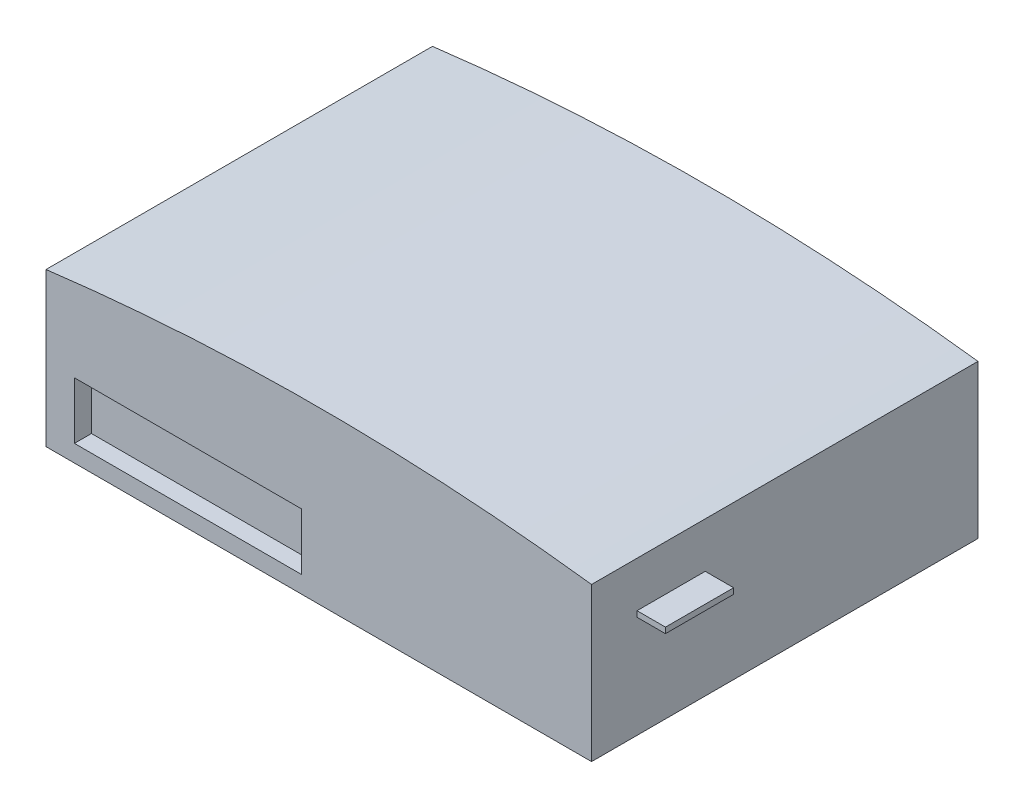
ISO-10303-21;
HEADER;
FILE_DESCRIPTION(('STEP AP214'),'2;1');
FILE_NAME('part.step','',(''),(''),'','','');
FILE_SCHEMA(('AUTOMOTIVE_DESIGN { 1 0 10303 214 1 1 1 1 }'));
ENDSEC;
DATA;
#1=APPLICATION_CONTEXT('core data for automotive mechanical design processes');
#2=APPLICATION_PROTOCOL_DEFINITION('international standard','automotive_design',2000,#1);
#3=PRODUCT_CONTEXT('',#1,'mechanical');
#4=PRODUCT('Part','Part','',(#3));
#5=PRODUCT_RELATED_PRODUCT_CATEGORY('part','',(#4));
#6=PRODUCT_DEFINITION_FORMATION('','',#4);
#7=PRODUCT_DEFINITION_CONTEXT('part definition',#1,'design');
#8=PRODUCT_DEFINITION('design','',#6,#7);
#9=PRODUCT_DEFINITION_SHAPE('','',#8);
#10=(LENGTH_UNIT() NAMED_UNIT(*) SI_UNIT(.MILLI.,.METRE.));
#11=(NAMED_UNIT(*) PLANE_ANGLE_UNIT() SI_UNIT($,.RADIAN.));
#12=(NAMED_UNIT(*) SI_UNIT($,.STERADIAN.) SOLID_ANGLE_UNIT());
#13=UNCERTAINTY_MEASURE_WITH_UNIT(LENGTH_MEASURE(1.E-05),#10,'distance_accuracy_value','');
#14=(GEOMETRIC_REPRESENTATION_CONTEXT(3) GLOBAL_UNCERTAINTY_ASSIGNED_CONTEXT((#13)) GLOBAL_UNIT_ASSIGNED_CONTEXT((#10,
#11,#12)) REPRESENTATION_CONTEXT('',''));
#15=CARTESIAN_POINT('',(0.,0.,0.));
#16=DIRECTION('',(0.,0.,1.));
#17=DIRECTION('',(1.,0.,0.));
#18=AXIS2_PLACEMENT_3D('',#15,#16,#17);
#19=CARTESIAN_POINT('',(48.,30.,34.));
#20=DIRECTION('',(-1.,0.,0.));
#21=DIRECTION('',(0.,0.,1.));
#22=AXIS2_PLACEMENT_3D('',#19,#20,#21);
#23=PLANE('',#22);
#24=DIRECTION('',(0.,-1.,0.));
#25=VECTOR('',#24,1.);
#26=CARTESIAN_POINT('',(48.,30.,-34.));
#27=LINE('',#26,#25);
#28=CARTESIAN_POINT('',(48.,27.,-34.));
#29=VERTEX_POINT('',#28);
#30=CARTESIAN_POINT('',(48.,0.,-34.));
#31=VERTEX_POINT('',#30);
#32=EDGE_CURVE('E11',#29,#31,#27,.T.);
#33=ORIENTED_EDGE('',*,*,#32,.F.);
#34=DIRECTION('',(0.,0.,1.));
#35=VECTOR('',#34,1.);
#36=CARTESIAN_POINT('',(48.,27.,-34.));
#37=LINE('',#36,#35);
#38=CARTESIAN_POINT('',(48.,27.,34.));
#39=VERTEX_POINT('',#38);
#40=EDGE_CURVE('E182',#29,#39,#37,.T.);
#41=ORIENTED_EDGE('',*,*,#40,.T.);
#42=DIRECTION('',(0.,-1.,0.));
#43=VECTOR('',#42,1.);
#44=CARTESIAN_POINT('',(48.,30.,34.));
#45=LINE('',#44,#43);
#46=CARTESIAN_POINT('',(48.,0.,34.));
#47=VERTEX_POINT('',#46);
#48=EDGE_CURVE('E200',#39,#47,#45,.T.);
#49=ORIENTED_EDGE('',*,*,#48,.T.);
#50=DIRECTION('',(0.,0.,-1.));
#51=VECTOR('',#50,1.);
#52=CARTESIAN_POINT('',(48.,0.,34.));
#53=LINE('',#52,#51);
#54=EDGE_CURVE('E186',#47,#31,#53,.T.);
#55=ORIENTED_EDGE('',*,*,#54,.T.);
#56=EDGE_LOOP('',(#33,#41,#49,#55));
#57=FACE_BOUND('',#56,.T.);
#58=DIRECTION('',(0.,-1.,0.));
#59=VECTOR('',#58,1.);
#60=CARTESIAN_POINT('',(48.,19.,26.));
#61=LINE('',#60,#59);
#62=CARTESIAN_POINT('',(48.,19.,26.));
#63=VERTEX_POINT('',#62);
#64=CARTESIAN_POINT('',(48.,18.,26.));
#65=VERTEX_POINT('',#64);
#66=EDGE_CURVE('E140',#63,#65,#61,.T.);
#67=ORIENTED_EDGE('',*,*,#66,.F.);
#68=DIRECTION('',(0.,0.,1.));
#69=VECTOR('',#68,1.);
#70=CARTESIAN_POINT('',(48.,19.,26.));
#71=LINE('',#70,#69);
#72=CARTESIAN_POINT('',(48.,19.,14.));
#73=VERTEX_POINT('',#72);
#74=EDGE_CURVE('E137',#73,#63,#71,.T.);
#75=ORIENTED_EDGE('',*,*,#74,.F.);
#76=DIRECTION('',(0.,1.,0.));
#77=VECTOR('',#76,1.);
#78=CARTESIAN_POINT('',(48.,19.,14.));
#79=LINE('',#78,#77);
#80=CARTESIAN_POINT('',(48.,18.,14.));
#81=VERTEX_POINT('',#80);
#82=EDGE_CURVE('E52',#81,#73,#79,.T.);
#83=ORIENTED_EDGE('',*,*,#82,.F.);
#84=DIRECTION('',(0.,0.,-1.));
#85=VECTOR('',#84,1.);
#86=CARTESIAN_POINT('',(48.,18.,26.));
#87=LINE('',#86,#85);
#88=EDGE_CURVE('E47',#65,#81,#87,.T.);
#89=ORIENTED_EDGE('',*,*,#88,.F.);
#90=EDGE_LOOP('',(#67,#75,#83,#89));
#91=FACE_BOUND('',#90,.T.);
#92=ADVANCED_FACE('F33',(#57,#91),#23,.F.);
#93=CARTESIAN_POINT('',(-48.,30.,-34.));
#94=DIRECTION('',(0.,0.,1.));
#95=DIRECTION('',(1.,0.,0.));
#96=AXIS2_PLACEMENT_3D('',#93,#94,#95);
#97=PLANE('',#96);
#98=DIRECTION('',(0.,-1.,0.));
#99=VECTOR('',#98,1.);
#100=CARTESIAN_POINT('',(-48.,30.,-34.));
#101=LINE('',#100,#99);
#102=CARTESIAN_POINT('',(-48.,27.,-34.));
#103=VERTEX_POINT('',#102);
#104=CARTESIAN_POINT('',(-48.,0.,-34.));
#105=VERTEX_POINT('',#104);
#106=EDGE_CURVE('E40',#103,#105,#101,.T.);
#107=ORIENTED_EDGE('',*,*,#106,.F.);
#108=CARTESIAN_POINT('',(0.,-355.5,-34.));
#109=DIRECTION('',(0.,0.,-1.));
#110=DIRECTION('',(-1.,0.,0.));
#111=AXIS2_PLACEMENT_3D('',#108,#109,#110);
#112=CIRCLE('',#111,385.5);
#113=EDGE_CURVE('E179',#103,#29,#112,.T.);
#114=ORIENTED_EDGE('',*,*,#113,.T.);
#115=ORIENTED_EDGE('',*,*,#32,.T.);
#116=DIRECTION('',(-1.,0.,0.));
#117=VECTOR('',#116,1.);
#118=CARTESIAN_POINT('',(-48.,0.,-34.));
#119=LINE('',#118,#117);
#120=EDGE_CURVE('E191',#31,#105,#119,.T.);
#121=ORIENTED_EDGE('',*,*,#120,.T.);
#122=EDGE_LOOP('',(#107,#114,#115,#121));
#123=FACE_BOUND('',#122,.T.);
#124=ADVANCED_FACE('F212',(#123),#97,.F.);
#125=CARTESIAN_POINT('',(-48.,30.,34.));
#126=DIRECTION('',(1.,0.,0.));
#127=DIRECTION('',(0.,0.,-1.));
#128=AXIS2_PLACEMENT_3D('',#125,#126,#127);
#129=PLANE('',#128);
#130=DIRECTION('',(0.,-1.,0.));
#131=VECTOR('',#130,1.);
#132=CARTESIAN_POINT('',(-48.,30.,34.));
#133=LINE('',#132,#131);
#134=CARTESIAN_POINT('',(-48.,27.,34.));
#135=VERTEX_POINT('',#134);
#136=CARTESIAN_POINT('',(-48.,0.,34.));
#137=VERTEX_POINT('',#136);
#138=EDGE_CURVE('E202',#135,#137,#133,.T.);
#139=ORIENTED_EDGE('',*,*,#138,.F.);
#140=DIRECTION('',(0.,0.,1.));
#141=VECTOR('',#140,1.);
#142=CARTESIAN_POINT('',(-48.,27.,-34.));
#143=LINE('',#142,#141);
#144=EDGE_CURVE('E184',#103,#135,#143,.T.);
#145=ORIENTED_EDGE('',*,*,#144,.F.);
#146=ORIENTED_EDGE('',*,*,#106,.T.);
#147=DIRECTION('',(0.,0.,1.));
#148=VECTOR('',#147,1.);
#149=CARTESIAN_POINT('',(-48.,0.,34.));
#150=LINE('',#149,#148);
#151=EDGE_CURVE('E194',#105,#137,#150,.T.);
#152=ORIENTED_EDGE('',*,*,#151,.T.);
#153=EDGE_LOOP('',(#139,#145,#146,#152));
#154=FACE_BOUND('',#153,.T.);
#155=ADVANCED_FACE('F207',(#154),#129,.F.);
#156=CARTESIAN_POINT('',(-48.,30.,34.));
#157=DIRECTION('',(0.,0.,-1.));
#158=DIRECTION('',(-1.,0.,0.));
#159=AXIS2_PLACEMENT_3D('',#156,#157,#158);
#160=PLANE('',#159);
#161=DIRECTION('',(1.,0.,0.));
#162=VECTOR('',#161,1.);
#163=CARTESIAN_POINT('',(-43.,3.,34.));
#164=LINE('',#163,#162);
#165=CARTESIAN_POINT('',(-43.,3.,34.));
#166=VERTEX_POINT('',#165);
#167=CARTESIAN_POINT('',(-2.99999999999999,3.,34.));
#168=VERTEX_POINT('',#167);
#169=EDGE_CURVE('E143',#166,#168,#164,.T.);
#170=ORIENTED_EDGE('',*,*,#169,.F.);
#171=DIRECTION('',(0.,-1.,0.));
#172=VECTOR('',#171,1.);
#173=CARTESIAN_POINT('',(-43.,13.,34.));
#174=LINE('',#173,#172);
#175=CARTESIAN_POINT('',(-43.,13.,34.));
#176=VERTEX_POINT('',#175);
#177=EDGE_CURVE('E141',#176,#166,#174,.T.);
#178=ORIENTED_EDGE('',*,*,#177,.F.);
#179=DIRECTION('',(-1.,0.,0.));
#180=VECTOR('',#179,1.);
#181=CARTESIAN_POINT('',(-43.,13.,34.));
#182=LINE('',#181,#180);
#183=CARTESIAN_POINT('',(-3.,13.,34.));
#184=VERTEX_POINT('',#183);
#185=EDGE_CURVE('E153',#184,#176,#182,.T.);
#186=ORIENTED_EDGE('',*,*,#185,.F.);
#187=DIRECTION('',(0.,1.,0.));
#188=VECTOR('',#187,1.);
#189=CARTESIAN_POINT('',(-3.,13.,34.));
#190=LINE('',#189,#188);
#191=EDGE_CURVE('E165',#168,#184,#190,.T.);
#192=ORIENTED_EDGE('',*,*,#191,.F.);
#193=EDGE_LOOP('',(#170,#178,#186,#192));
#194=FACE_BOUND('',#193,.T.);
#195=ORIENTED_EDGE('',*,*,#48,.F.);
#196=CARTESIAN_POINT('',(0.,-355.5,34.));
#197=DIRECTION('',(0.,0.,-1.));
#198=DIRECTION('',(-1.,0.,0.));
#199=AXIS2_PLACEMENT_3D('',#196,#197,#198);
#200=CIRCLE('',#199,385.5);
#201=EDGE_CURVE('E172',#135,#39,#200,.T.);
#202=ORIENTED_EDGE('',*,*,#201,.F.);
#203=ORIENTED_EDGE('',*,*,#138,.T.);
#204=DIRECTION('',(1.,0.,0.));
#205=VECTOR('',#204,1.);
#206=CARTESIAN_POINT('',(-48.,0.,34.));
#207=LINE('',#206,#205);
#208=EDGE_CURVE('E197',#137,#47,#207,.T.);
#209=ORIENTED_EDGE('',*,*,#208,.T.);
#210=EDGE_LOOP('',(#195,#202,#203,#209));
#211=FACE_BOUND('',#210,.T.);
#212=ADVANCED_FACE('F219',(#194,#211),#160,.F.);
#213=CARTESIAN_POINT('',(0.,0.,0.));
#214=DIRECTION('',(0.,-1.,0.));
#215=DIRECTION('',(0.,0.,-1.));
#216=AXIS2_PLACEMENT_3D('',#213,#214,#215);
#217=PLANE('',#216);
#218=CARTESIAN_POINT('',(-38.,0.,-25.));
#219=DIRECTION('',(0.,-1.,0.));
#220=DIRECTION('',(0.,0.,-1.));
#221=AXIS2_PLACEMENT_3D('',#218,#219,#220);
#222=CIRCLE('',#221,2.8);
#223=CARTESIAN_POINT('',(-38.,0.,-27.8));
#224=VERTEX_POINT('',#223);
#225=EDGE_CURVE('E246',#224,#224,#222,.T.);
#226=ORIENTED_EDGE('',*,*,#225,.F.);
#227=EDGE_LOOP('',(#226));
#228=FACE_BOUND('',#227,.T.);
#229=CARTESIAN_POINT('',(20.,0.,-25.));
#230=DIRECTION('',(0.,-1.,0.));
#231=DIRECTION('',(0.,0.,-1.));
#232=AXIS2_PLACEMENT_3D('',#229,#230,#231);
#233=CIRCLE('',#232,2.8);
#234=CARTESIAN_POINT('',(20.,0.,-27.8));
#235=VERTEX_POINT('',#234);
#236=EDGE_CURVE('E253',#235,#235,#233,.T.);
#237=ORIENTED_EDGE('',*,*,#236,.F.);
#238=EDGE_LOOP('',(#237));
#239=FACE_BOUND('',#238,.T.);
#240=CARTESIAN_POINT('',(20.,0.,24.));
#241=DIRECTION('',(0.,-1.,0.));
#242=DIRECTION('',(0.,0.,-1.));
#243=AXIS2_PLACEMENT_3D('',#240,#241,#242);
#244=CIRCLE('',#243,2.8);
#245=CARTESIAN_POINT('',(20.,0.,21.2));
#246=VERTEX_POINT('',#245);
#247=EDGE_CURVE('E259',#246,#246,#244,.T.);
#248=ORIENTED_EDGE('',*,*,#247,.F.);
#249=EDGE_LOOP('',(#248));
#250=FACE_BOUND('',#249,.T.);
#251=CARTESIAN_POINT('',(-38.,0.,24.));
#252=DIRECTION('',(0.,-1.,0.));
#253=DIRECTION('',(0.,0.,-1.));
#254=AXIS2_PLACEMENT_3D('',#251,#252,#253);
#255=CIRCLE('',#254,2.8);
#256=CARTESIAN_POINT('',(-38.,0.,21.2));
#257=VERTEX_POINT('',#256);
#258=EDGE_CURVE('E240',#257,#257,#255,.T.);
#259=ORIENTED_EDGE('',*,*,#258,.F.);
#260=EDGE_LOOP('',(#259));
#261=FACE_BOUND('',#260,.T.);
#262=ORIENTED_EDGE('',*,*,#54,.F.);
#263=ORIENTED_EDGE('',*,*,#208,.F.);
#264=ORIENTED_EDGE('',*,*,#151,.F.);
#265=ORIENTED_EDGE('',*,*,#120,.F.);
#266=EDGE_LOOP('',(#262,#263,#264,#265));
#267=FACE_BOUND('',#266,.T.);
#268=ADVANCED_FACE('F216',(#228,#239,#250,#261,#267),#217,.T.);
#269=CARTESIAN_POINT('',(0.,-355.5,-34.));
#270=DIRECTION('',(0.,0.,1.));
#271=DIRECTION('',(1.,0.,0.));
#272=AXIS2_PLACEMENT_3D('',#269,#270,#271);
#273=CYLINDRICAL_SURFACE('',#272,385.5);
#274=ORIENTED_EDGE('',*,*,#201,.T.);
#275=ORIENTED_EDGE('',*,*,#40,.F.);
#276=ORIENTED_EDGE('',*,*,#113,.F.);
#277=ORIENTED_EDGE('',*,*,#144,.T.);
#278=EDGE_LOOP('',(#274,#275,#276,#277));
#279=FACE_BOUND('',#278,.T.);
#280=ADVANCED_FACE('F222',(#279),#273,.T.);
#281=CARTESIAN_POINT('',(-43.,13.,31.));
#282=DIRECTION('',(-1.,0.,0.));
#283=DIRECTION('',(0.,0.,1.));
#284=AXIS2_PLACEMENT_3D('',#281,#282,#283);
#285=PLANE('',#284);
#286=ORIENTED_EDGE('',*,*,#177,.T.);
#287=DIRECTION('',(0.,0.,1.));
#288=VECTOR('',#287,1.);
#289=CARTESIAN_POINT('',(-43.,3.,31.));
#290=LINE('',#289,#288);
#291=CARTESIAN_POINT('',(-43.,3.,31.));
#292=VERTEX_POINT('',#291);
#293=EDGE_CURVE('E161',#292,#166,#290,.T.);
#294=ORIENTED_EDGE('',*,*,#293,.F.);
#295=DIRECTION('',(0.,-1.,0.));
#296=VECTOR('',#295,1.);
#297=CARTESIAN_POINT('',(-43.,13.,31.));
#298=LINE('',#297,#296);
#299=CARTESIAN_POINT('',(-43.,13.,31.));
#300=VERTEX_POINT('',#299);
#301=EDGE_CURVE('E149',#300,#292,#298,.T.);
#302=ORIENTED_EDGE('',*,*,#301,.F.);
#303=DIRECTION('',(0.,0.,1.));
#304=VECTOR('',#303,1.);
#305=CARTESIAN_POINT('',(-43.,13.,31.));
#306=LINE('',#305,#304);
#307=EDGE_CURVE('E170',#300,#176,#306,.T.);
#308=ORIENTED_EDGE('',*,*,#307,.T.);
#309=EDGE_LOOP('',(#286,#294,#302,#308));
#310=FACE_BOUND('',#309,.T.);
#311=ADVANCED_FACE('F376',(#310),#285,.F.);
#312=CARTESIAN_POINT('',(-43.,13.,31.));
#313=DIRECTION('',(0.,1.,0.));
#314=DIRECTION('',(0.,0.,1.));
#315=AXIS2_PLACEMENT_3D('',#312,#313,#314);
#316=PLANE('',#315);
#317=ORIENTED_EDGE('',*,*,#185,.T.);
#318=ORIENTED_EDGE('',*,*,#307,.F.);
#319=DIRECTION('',(-1.,0.,0.));
#320=VECTOR('',#319,1.);
#321=CARTESIAN_POINT('',(-43.,13.,31.));
#322=LINE('',#321,#320);
#323=CARTESIAN_POINT('',(-3.,13.,31.));
#324=VERTEX_POINT('',#323);
#325=EDGE_CURVE('E159',#324,#300,#322,.T.);
#326=ORIENTED_EDGE('',*,*,#325,.F.);
#327=DIRECTION('',(0.,0.,1.));
#328=VECTOR('',#327,1.);
#329=CARTESIAN_POINT('',(-3.,13.,31.));
#330=LINE('',#329,#328);
#331=EDGE_CURVE('E173',#324,#184,#330,.T.);
#332=ORIENTED_EDGE('',*,*,#331,.T.);
#333=EDGE_LOOP('',(#317,#318,#326,#332));
#334=FACE_BOUND('',#333,.T.);
#335=ADVANCED_FACE('F372',(#334),#316,.F.);
#336=CARTESIAN_POINT('',(-3.,13.,31.));
#337=DIRECTION('',(1.,0.,0.));
#338=DIRECTION('',(0.,1.,0.));
#339=AXIS2_PLACEMENT_3D('',#336,#337,#338);
#340=PLANE('',#339);
#341=ORIENTED_EDGE('',*,*,#191,.T.);
#342=ORIENTED_EDGE('',*,*,#331,.F.);
#343=DIRECTION('',(0.,1.,0.));
#344=VECTOR('',#343,1.);
#345=CARTESIAN_POINT('',(-3.,13.,31.));
#346=LINE('',#345,#344);
#347=CARTESIAN_POINT('',(-2.99999999999999,3.,31.));
#348=VERTEX_POINT('',#347);
#349=EDGE_CURVE('E156',#348,#324,#346,.T.);
#350=ORIENTED_EDGE('',*,*,#349,.F.);
#351=DIRECTION('',(0.,0.,1.));
#352=VECTOR('',#351,1.);
#353=CARTESIAN_POINT('',(-2.99999999999999,3.,31.));
#354=LINE('',#353,#352);
#355=EDGE_CURVE('E175',#348,#168,#354,.T.);
#356=ORIENTED_EDGE('',*,*,#355,.T.);
#357=EDGE_LOOP('',(#341,#342,#350,#356));
#358=FACE_BOUND('',#357,.T.);
#359=ADVANCED_FACE('F375',(#358),#340,.F.);
#360=CARTESIAN_POINT('',(-43.,3.,31.));
#361=DIRECTION('',(0.,-1.,0.));
#362=DIRECTION('',(1.,0.,0.));
#363=AXIS2_PLACEMENT_3D('',#360,#361,#362);
#364=PLANE('',#363);
#365=ORIENTED_EDGE('',*,*,#169,.T.);
#366=ORIENTED_EDGE('',*,*,#355,.F.);
#367=DIRECTION('',(1.,0.,0.));
#368=VECTOR('',#367,1.);
#369=CARTESIAN_POINT('',(-43.,3.,31.));
#370=LINE('',#369,#368);
#371=EDGE_CURVE('E152',#292,#348,#370,.T.);
#372=ORIENTED_EDGE('',*,*,#371,.F.);
#373=ORIENTED_EDGE('',*,*,#293,.T.);
#374=EDGE_LOOP('',(#365,#366,#372,#373));
#375=FACE_BOUND('',#374,.T.);
#376=ADVANCED_FACE('F370',(#375),#364,.F.);
#377=CARTESIAN_POINT('',(0.,0.,31.));
#378=DIRECTION('',(0.,0.,1.));
#379=DIRECTION('',(1.,0.,0.));
#380=AXIS2_PLACEMENT_3D('',#377,#378,#379);
#381=PLANE('',#380);
#382=ORIENTED_EDGE('',*,*,#301,.T.);
#383=ORIENTED_EDGE('',*,*,#371,.T.);
#384=ORIENTED_EDGE('',*,*,#349,.T.);
#385=ORIENTED_EDGE('',*,*,#325,.T.);
#386=EDGE_LOOP('',(#382,#383,#384,#385));
#387=FACE_BOUND('',#386,.T.);
#388=ADVANCED_FACE('F367',(#387),#381,.T.);
#389=CARTESIAN_POINT('',(53.,19.,26.));
#390=DIRECTION('',(0.,0.,-1.));
#391=DIRECTION('',(-1.,0.,0.));
#392=AXIS2_PLACEMENT_3D('',#389,#390,#391);
#393=PLANE('',#392);
#394=ORIENTED_EDGE('',*,*,#66,.T.);
#395=DIRECTION('',(-1.,0.,0.));
#396=VECTOR('',#395,1.);
#397=CARTESIAN_POINT('',(53.,18.,26.));
#398=LINE('',#397,#396);
#399=CARTESIAN_POINT('',(53.,18.,26.));
#400=VERTEX_POINT('',#399);
#401=EDGE_CURVE('E121',#400,#65,#398,.T.);
#402=ORIENTED_EDGE('',*,*,#401,.F.);
#403=DIRECTION('',(0.,-1.,0.));
#404=VECTOR('',#403,1.);
#405=CARTESIAN_POINT('',(53.,19.,26.));
#406=LINE('',#405,#404);
#407=CARTESIAN_POINT('',(53.,19.,26.));
#408=VERTEX_POINT('',#407);
#409=EDGE_CURVE('E128',#408,#400,#406,.T.);
#410=ORIENTED_EDGE('',*,*,#409,.F.);
#411=DIRECTION('',(-1.,0.,0.));
#412=VECTOR('',#411,1.);
#413=CARTESIAN_POINT('',(53.,19.,26.));
#414=LINE('',#413,#412);
#415=EDGE_CURVE('E231',#408,#63,#414,.T.);
#416=ORIENTED_EDGE('',*,*,#415,.T.);
#417=EDGE_LOOP('',(#394,#402,#410,#416));
#418=FACE_BOUND('',#417,.T.);
#419=ADVANCED_FACE('F139',(#418),#393,.F.);
#420=CARTESIAN_POINT('',(53.,18.,26.));
#421=DIRECTION('',(0.,1.,0.));
#422=DIRECTION('',(0.,0.,1.));
#423=AXIS2_PLACEMENT_3D('',#420,#421,#422);
#424=PLANE('',#423);
#425=ORIENTED_EDGE('',*,*,#88,.T.);
#426=DIRECTION('',(-1.,0.,0.));
#427=VECTOR('',#426,1.);
#428=CARTESIAN_POINT('',(53.,18.,14.));
#429=LINE('',#428,#427);
#430=CARTESIAN_POINT('',(53.,18.,14.));
#431=VERTEX_POINT('',#430);
#432=EDGE_CURVE('E124',#431,#81,#429,.T.);
#433=ORIENTED_EDGE('',*,*,#432,.F.);
#434=DIRECTION('',(0.,0.,-1.));
#435=VECTOR('',#434,1.);
#436=CARTESIAN_POINT('',(53.,18.,26.));
#437=LINE('',#436,#435);
#438=EDGE_CURVE('E117',#400,#431,#437,.T.);
#439=ORIENTED_EDGE('',*,*,#438,.F.);
#440=ORIENTED_EDGE('',*,*,#401,.T.);
#441=EDGE_LOOP('',(#425,#433,#439,#440));
#442=FACE_BOUND('',#441,.T.);
#443=ADVANCED_FACE('F119',(#442),#424,.F.);
#444=CARTESIAN_POINT('',(53.,19.,14.));
#445=DIRECTION('',(0.,0.,1.));
#446=DIRECTION('',(1.,0.,0.));
#447=AXIS2_PLACEMENT_3D('',#444,#445,#446);
#448=PLANE('',#447);
#449=ORIENTED_EDGE('',*,*,#82,.T.);
#450=DIRECTION('',(-1.,0.,0.));
#451=VECTOR('',#450,1.);
#452=CARTESIAN_POINT('',(53.,19.,14.));
#453=LINE('',#452,#451);
#454=CARTESIAN_POINT('',(53.,19.,14.));
#455=VERTEX_POINT('',#454);
#456=EDGE_CURVE('E145',#455,#73,#453,.T.);
#457=ORIENTED_EDGE('',*,*,#456,.F.);
#458=DIRECTION('',(0.,1.,0.));
#459=VECTOR('',#458,1.);
#460=CARTESIAN_POINT('',(53.,19.,14.));
#461=LINE('',#460,#459);
#462=EDGE_CURVE('E127',#431,#455,#461,.T.);
#463=ORIENTED_EDGE('',*,*,#462,.F.);
#464=ORIENTED_EDGE('',*,*,#432,.T.);
#465=EDGE_LOOP('',(#449,#457,#463,#464));
#466=FACE_BOUND('',#465,.T.);
#467=ADVANCED_FACE('F359',(#466),#448,.F.);
#468=CARTESIAN_POINT('',(53.,19.,26.));
#469=DIRECTION('',(0.,-1.,0.));
#470=DIRECTION('',(0.,0.,-1.));
#471=AXIS2_PLACEMENT_3D('',#468,#469,#470);
#472=PLANE('',#471);
#473=ORIENTED_EDGE('',*,*,#74,.T.);
#474=ORIENTED_EDGE('',*,*,#415,.F.);
#475=DIRECTION('',(0.,0.,1.));
#476=VECTOR('',#475,1.);
#477=CARTESIAN_POINT('',(53.,19.,26.));
#478=LINE('',#477,#476);
#479=EDGE_CURVE('E133',#455,#408,#478,.T.);
#480=ORIENTED_EDGE('',*,*,#479,.F.);
#481=ORIENTED_EDGE('',*,*,#456,.T.);
#482=EDGE_LOOP('',(#473,#474,#480,#481));
#483=FACE_BOUND('',#482,.T.);
#484=ADVANCED_FACE('F230',(#483),#472,.F.);
#485=CARTESIAN_POINT('',(53.,0.,0.));
#486=DIRECTION('',(1.,0.,0.));
#487=DIRECTION('',(0.,0.,-1.));
#488=AXIS2_PLACEMENT_3D('',#485,#486,#487);
#489=PLANE('',#488);
#490=ORIENTED_EDGE('',*,*,#409,.T.);
#491=ORIENTED_EDGE('',*,*,#438,.T.);
#492=ORIENTED_EDGE('',*,*,#462,.T.);
#493=ORIENTED_EDGE('',*,*,#479,.T.);
#494=EDGE_LOOP('',(#490,#491,#492,#493));
#495=FACE_BOUND('',#494,.T.);
#496=ADVANCED_FACE('F131',(#495),#489,.T.);
#497=CARTESIAN_POINT('',(-38.,2.2,24.));
#498=DIRECTION('',(0.,-1.,0.));
#499=DIRECTION('',(0.,0.,-1.));
#500=AXIS2_PLACEMENT_3D('',#497,#498,#499);
#501=CYLINDRICAL_SURFACE('',#500,2.8);
#502=CARTESIAN_POINT('',(-38.,2.2,24.));
#503=DIRECTION('',(0.,-1.,0.));
#504=DIRECTION('',(0.,0.,-1.));
#505=AXIS2_PLACEMENT_3D('',#502,#503,#504);
#506=CIRCLE('',#505,2.8);
#507=CARTESIAN_POINT('',(-38.,2.2,21.2));
#508=VERTEX_POINT('',#507);
#509=EDGE_CURVE('E226',#508,#508,#506,.T.);
#510=ORIENTED_EDGE('',*,*,#509,.F.);
#511=EDGE_LOOP('',(#510));
#512=FACE_BOUND('',#511,.T.);
#513=ORIENTED_EDGE('',*,*,#258,.T.);
#514=EDGE_LOOP('',(#513));
#515=FACE_BOUND('',#514,.T.);
#516=ADVANCED_FACE('F350',(#512,#515),#501,.F.);
#517=CARTESIAN_POINT('',(-38.,2.2,24.));
#518=DIRECTION('',(0.,-1.,0.));
#519=DIRECTION('',(0.,0.,-1.));
#520=AXIS2_PLACEMENT_3D('',#517,#518,#519);
#521=PLANE('',#520);
#522=CARTESIAN_POINT('',(-38.,2.2,24.));
#523=DIRECTION('',(0.,-1.,0.));
#524=DIRECTION('',(0.,0.,-1.));
#525=AXIS2_PLACEMENT_3D('',#522,#523,#524);
#526=CIRCLE('',#525,1.5);
#527=CARTESIAN_POINT('',(-38.,2.2,22.5));
#528=VERTEX_POINT('',#527);
#529=EDGE_CURVE('E250',#528,#528,#526,.T.);
#530=ORIENTED_EDGE('',*,*,#529,.F.);
#531=EDGE_LOOP('',(#530));
#532=FACE_BOUND('',#531,.T.);
#533=ORIENTED_EDGE('',*,*,#509,.T.);
#534=EDGE_LOOP('',(#533));
#535=FACE_BOUND('',#534,.T.);
#536=ADVANCED_FACE('F332',(#532,#535),#521,.T.);
#537=CARTESIAN_POINT('',(20.,2.2,24.));
#538=DIRECTION('',(0.,-1.,0.));
#539=DIRECTION('',(0.,0.,-1.));
#540=AXIS2_PLACEMENT_3D('',#537,#538,#539);
#541=CYLINDRICAL_SURFACE('',#540,2.8);
#542=CARTESIAN_POINT('',(20.,2.2,24.));
#543=DIRECTION('',(0.,-1.,0.));
#544=DIRECTION('',(0.,0.,-1.));
#545=AXIS2_PLACEMENT_3D('',#542,#543,#544);
#546=CIRCLE('',#545,2.8);
#547=CARTESIAN_POINT('',(20.,2.2,21.2));
#548=VERTEX_POINT('',#547);
#549=EDGE_CURVE('E243',#548,#548,#546,.T.);
#550=ORIENTED_EDGE('',*,*,#549,.F.);
#551=EDGE_LOOP('',(#550));
#552=FACE_BOUND('',#551,.T.);
#553=ORIENTED_EDGE('',*,*,#247,.T.);
#554=EDGE_LOOP('',(#553));
#555=FACE_BOUND('',#554,.T.);
#556=ADVANCED_FACE('F328',(#552,#555),#541,.F.);
#557=CARTESIAN_POINT('',(20.,2.2,24.));
#558=DIRECTION('',(0.,-1.,0.));
#559=DIRECTION('',(0.,0.,-1.));
#560=AXIS2_PLACEMENT_3D('',#557,#558,#559);
#561=PLANE('',#560);
#562=CARTESIAN_POINT('',(20.,2.2,24.));
#563=DIRECTION('',(0.,-1.,0.));
#564=DIRECTION('',(0.,0.,-1.));
#565=AXIS2_PLACEMENT_3D('',#562,#563,#564);
#566=CIRCLE('',#565,1.5);
#567=CARTESIAN_POINT('',(20.,2.2,22.5));
#568=VERTEX_POINT('',#567);
#569=EDGE_CURVE('E266',#568,#568,#566,.T.);
#570=ORIENTED_EDGE('',*,*,#569,.F.);
#571=EDGE_LOOP('',(#570));
#572=FACE_BOUND('',#571,.T.);
#573=ORIENTED_EDGE('',*,*,#549,.T.);
#574=EDGE_LOOP('',(#573));
#575=FACE_BOUND('',#574,.T.);
#576=ADVANCED_FACE('F324',(#572,#575),#561,.T.);
#577=CARTESIAN_POINT('',(20.,2.2,-25.));
#578=DIRECTION('',(0.,-1.,0.));
#579=DIRECTION('',(0.,0.,-1.));
#580=AXIS2_PLACEMENT_3D('',#577,#578,#579);
#581=CYLINDRICAL_SURFACE('',#580,2.8);
#582=CARTESIAN_POINT('',(20.,2.2,-25.));
#583=DIRECTION('',(0.,-1.,0.));
#584=DIRECTION('',(0.,0.,-1.));
#585=AXIS2_PLACEMENT_3D('',#582,#583,#584);
#586=CIRCLE('',#585,2.8);
#587=CARTESIAN_POINT('',(20.,2.2,-27.8));
#588=VERTEX_POINT('',#587);
#589=EDGE_CURVE('E256',#588,#588,#586,.T.);
#590=ORIENTED_EDGE('',*,*,#589,.F.);
#591=EDGE_LOOP('',(#590));
#592=FACE_BOUND('',#591,.T.);
#593=ORIENTED_EDGE('',*,*,#236,.T.);
#594=EDGE_LOOP('',(#593));
#595=FACE_BOUND('',#594,.T.);
#596=ADVANCED_FACE('F327',(#592,#595),#581,.F.);
#597=CARTESIAN_POINT('',(20.,2.2,-25.));
#598=DIRECTION('',(0.,-1.,0.));
#599=DIRECTION('',(0.,0.,-1.));
#600=AXIS2_PLACEMENT_3D('',#597,#598,#599);
#601=PLANE('',#600);
#602=CARTESIAN_POINT('',(20.,2.2,-25.));
#603=DIRECTION('',(0.,-1.,0.));
#604=DIRECTION('',(0.,0.,-1.));
#605=AXIS2_PLACEMENT_3D('',#602,#603,#604);
#606=CIRCLE('',#605,1.5);
#607=CARTESIAN_POINT('',(20.,2.2,-26.5));
#608=VERTEX_POINT('',#607);
#609=EDGE_CURVE('E269',#608,#608,#606,.T.);
#610=ORIENTED_EDGE('',*,*,#609,.F.);
#611=EDGE_LOOP('',(#610));
#612=FACE_BOUND('',#611,.T.);
#613=ORIENTED_EDGE('',*,*,#589,.T.);
#614=EDGE_LOOP('',(#613));
#615=FACE_BOUND('',#614,.T.);
#616=ADVANCED_FACE('F334',(#612,#615),#601,.T.);
#617=CARTESIAN_POINT('',(-38.,2.2,-25.));
#618=DIRECTION('',(0.,-1.,0.));
#619=DIRECTION('',(0.,0.,-1.));
#620=AXIS2_PLACEMENT_3D('',#617,#618,#619);
#621=CYLINDRICAL_SURFACE('',#620,2.8);
#622=CARTESIAN_POINT('',(-38.,2.2,-25.));
#623=DIRECTION('',(0.,-1.,0.));
#624=DIRECTION('',(0.,0.,-1.));
#625=AXIS2_PLACEMENT_3D('',#622,#623,#624);
#626=CIRCLE('',#625,2.8);
#627=CARTESIAN_POINT('',(-38.,2.2,-27.8));
#628=VERTEX_POINT('',#627);
#629=EDGE_CURVE('E249',#628,#628,#626,.T.);
#630=ORIENTED_EDGE('',*,*,#629,.F.);
#631=EDGE_LOOP('',(#630));
#632=FACE_BOUND('',#631,.T.);
#633=ORIENTED_EDGE('',*,*,#225,.T.);
#634=EDGE_LOOP('',(#633));
#635=FACE_BOUND('',#634,.T.);
#636=ADVANCED_FACE('F337',(#632,#635),#621,.F.);
#637=CARTESIAN_POINT('',(-38.,2.2,-25.));
#638=DIRECTION('',(0.,-1.,0.));
#639=DIRECTION('',(0.,0.,-1.));
#640=AXIS2_PLACEMENT_3D('',#637,#638,#639);
#641=PLANE('',#640);
#642=CARTESIAN_POINT('',(-38.,2.2,-25.));
#643=DIRECTION('',(0.,-1.,0.));
#644=DIRECTION('',(0.,0.,-1.));
#645=AXIS2_PLACEMENT_3D('',#642,#643,#644);
#646=CIRCLE('',#645,1.5);
#647=CARTESIAN_POINT('',(-38.,2.2,-26.5));
#648=VERTEX_POINT('',#647);
#649=EDGE_CURVE('E272',#648,#648,#646,.T.);
#650=ORIENTED_EDGE('',*,*,#649,.F.);
#651=EDGE_LOOP('',(#650));
#652=FACE_BOUND('',#651,.T.);
#653=ORIENTED_EDGE('',*,*,#629,.T.);
#654=EDGE_LOOP('',(#653));
#655=FACE_BOUND('',#654,.T.);
#656=ADVANCED_FACE('F315',(#652,#655),#641,.T.);
#657=CARTESIAN_POINT('',(-38.,10.,-25.));
#658=DIRECTION('',(0.,-1.,0.));
#659=DIRECTION('',(0.,0.,-1.));
#660=AXIS2_PLACEMENT_3D('',#657,#658,#659);
#661=CYLINDRICAL_SURFACE('',#660,1.5);
#662=ORIENTED_EDGE('',*,*,#649,.T.);
#663=EDGE_LOOP('',(#662));
#664=FACE_BOUND('',#663,.T.);
#665=CARTESIAN_POINT('',(-38.,10.,-25.));
#666=DIRECTION('',(0.,-1.,0.));
#667=DIRECTION('',(0.,0.,-1.));
#668=AXIS2_PLACEMENT_3D('',#665,#666,#667);
#669=CIRCLE('',#668,1.5);
#670=CARTESIAN_POINT('',(-38.,10.,-26.5));
#671=VERTEX_POINT('',#670);
#672=EDGE_CURVE('E279',#671,#671,#669,.T.);
#673=ORIENTED_EDGE('',*,*,#672,.F.);
#674=EDGE_LOOP('',(#673));
#675=FACE_BOUND('',#674,.T.);
#676=ADVANCED_FACE('F301',(#664,#675),#661,.F.);
#677=CARTESIAN_POINT('',(0.,10.,0.));
#678=DIRECTION('',(0.,-1.,0.));
#679=DIRECTION('',(0.,0.,-1.));
#680=AXIS2_PLACEMENT_3D('',#677,#678,#679);
#681=PLANE('',#680);
#682=ORIENTED_EDGE('',*,*,#672,.T.);
#683=EDGE_LOOP('',(#682));
#684=FACE_BOUND('',#683,.T.);
#685=ADVANCED_FACE('F292',(#684),#681,.T.);
#686=CARTESIAN_POINT('',(20.,10.,-25.));
#687=DIRECTION('',(0.,-1.,0.));
#688=DIRECTION('',(0.,0.,-1.));
#689=AXIS2_PLACEMENT_3D('',#686,#687,#688);
#690=CYLINDRICAL_SURFACE('',#689,1.5);
#691=ORIENTED_EDGE('',*,*,#609,.T.);
#692=EDGE_LOOP('',(#691));
#693=FACE_BOUND('',#692,.T.);
#694=CARTESIAN_POINT('',(20.,10.,-25.));
#695=DIRECTION('',(0.,-1.,0.));
#696=DIRECTION('',(0.,0.,-1.));
#697=AXIS2_PLACEMENT_3D('',#694,#695,#696);
#698=CIRCLE('',#697,1.5);
#699=CARTESIAN_POINT('',(20.,10.,-26.5));
#700=VERTEX_POINT('',#699);
#701=EDGE_CURVE('E282',#700,#700,#698,.T.);
#702=ORIENTED_EDGE('',*,*,#701,.F.);
#703=EDGE_LOOP('',(#702));
#704=FACE_BOUND('',#703,.T.);
#705=ADVANCED_FACE('F290',(#693,#704),#690,.F.);
#706=CARTESIAN_POINT('',(0.,10.,0.));
#707=DIRECTION('',(0.,-1.,0.));
#708=DIRECTION('',(0.,0.,-1.));
#709=AXIS2_PLACEMENT_3D('',#706,#707,#708);
#710=PLANE('',#709);
#711=ORIENTED_EDGE('',*,*,#701,.T.);
#712=EDGE_LOOP('',(#711));
#713=FACE_BOUND('',#712,.T.);
#714=ADVANCED_FACE('F288',(#713),#710,.T.);
#715=CARTESIAN_POINT('',(20.,10.,24.));
#716=DIRECTION('',(0.,-1.,0.));
#717=DIRECTION('',(0.,0.,-1.));
#718=AXIS2_PLACEMENT_3D('',#715,#716,#717);
#719=CYLINDRICAL_SURFACE('',#718,1.5);
#720=ORIENTED_EDGE('',*,*,#569,.T.);
#721=EDGE_LOOP('',(#720));
#722=FACE_BOUND('',#721,.T.);
#723=CARTESIAN_POINT('',(20.,10.,24.));
#724=DIRECTION('',(0.,-1.,0.));
#725=DIRECTION('',(0.,0.,-1.));
#726=AXIS2_PLACEMENT_3D('',#723,#724,#725);
#727=CIRCLE('',#726,1.5);
#728=CARTESIAN_POINT('',(20.,10.,22.5));
#729=VERTEX_POINT('',#728);
#730=EDGE_CURVE('E278',#729,#729,#727,.T.);
#731=ORIENTED_EDGE('',*,*,#730,.F.);
#732=EDGE_LOOP('',(#731));
#733=FACE_BOUND('',#732,.T.);
#734=ADVANCED_FACE('F299',(#722,#733),#719,.F.);
#735=CARTESIAN_POINT('',(0.,10.,0.));
#736=DIRECTION('',(0.,-1.,0.));
#737=DIRECTION('',(0.,0.,-1.));
#738=AXIS2_PLACEMENT_3D('',#735,#736,#737);
#739=PLANE('',#738);
#740=ORIENTED_EDGE('',*,*,#730,.T.);
#741=EDGE_LOOP('',(#740));
#742=FACE_BOUND('',#741,.T.);
#743=ADVANCED_FACE('F305',(#742),#739,.T.);
#744=CARTESIAN_POINT('',(-38.,10.,24.));
#745=DIRECTION('',(0.,-1.,0.));
#746=DIRECTION('',(0.,0.,-1.));
#747=AXIS2_PLACEMENT_3D('',#744,#745,#746);
#748=CYLINDRICAL_SURFACE('',#747,1.5);
#749=ORIENTED_EDGE('',*,*,#529,.T.);
#750=EDGE_LOOP('',(#749));
#751=FACE_BOUND('',#750,.T.);
#752=CARTESIAN_POINT('',(-38.,10.,24.));
#753=DIRECTION('',(0.,-1.,0.));
#754=DIRECTION('',(0.,0.,-1.));
#755=AXIS2_PLACEMENT_3D('',#752,#753,#754);
#756=CIRCLE('',#755,1.5);
#757=CARTESIAN_POINT('',(-38.,10.,22.5));
#758=VERTEX_POINT('',#757);
#759=EDGE_CURVE('E275',#758,#758,#756,.T.);
#760=ORIENTED_EDGE('',*,*,#759,.F.);
#761=EDGE_LOOP('',(#760));
#762=FACE_BOUND('',#761,.T.);
#763=ADVANCED_FACE('F308',(#751,#762),#748,.F.);
#764=CARTESIAN_POINT('',(0.,10.,0.));
#765=DIRECTION('',(0.,-1.,0.));
#766=DIRECTION('',(0.,0.,-1.));
#767=AXIS2_PLACEMENT_3D('',#764,#765,#766);
#768=PLANE('',#767);
#769=ORIENTED_EDGE('',*,*,#759,.T.);
#770=EDGE_LOOP('',(#769));
#771=FACE_BOUND('',#770,.T.);
#772=ADVANCED_FACE('F317',(#771),#768,.T.);
#773=CLOSED_SHELL('',(#92,#124,#155,#212,#268,#280,#311,#335,#359,#376,#388,#419,#443,#467,#484,
#496,#516,#536,#556,#576,#596,#616,#636,#656,#676,#685,#705,#714,#734,#743,#763,#772));
#774=MANIFOLD_SOLID_BREP('B2',#773);
#775=ADVANCED_BREP_SHAPE_REPRESENTATION('',(#18,#774),#14);
#776=SHAPE_DEFINITION_REPRESENTATION(#9,#775);
ENDSEC;
END-ISO-10303-21;
